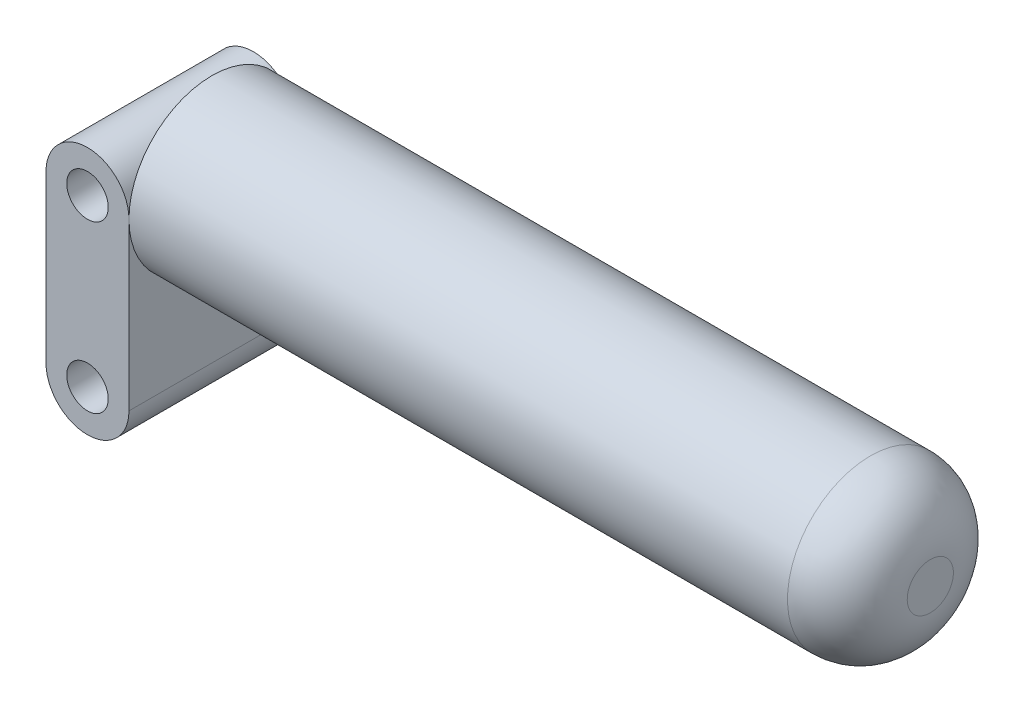
ISO-10303-21;
HEADER;
FILE_DESCRIPTION(('STEP AP214'),'2;1');
FILE_NAME('part.step','',(''),(''),'','','');
FILE_SCHEMA(('AUTOMOTIVE_DESIGN { 1 0 10303 214 1 1 1 1 }'));
ENDSEC;
DATA;
#1=APPLICATION_CONTEXT('core data for automotive mechanical design processes');
#2=APPLICATION_PROTOCOL_DEFINITION('international standard','automotive_design',2000,#1);
#3=PRODUCT_CONTEXT('',#1,'mechanical');
#4=PRODUCT('Part','Part','',(#3));
#5=PRODUCT_RELATED_PRODUCT_CATEGORY('part','',(#4));
#6=PRODUCT_DEFINITION_FORMATION('','',#4);
#7=PRODUCT_DEFINITION_CONTEXT('part definition',#1,'design');
#8=PRODUCT_DEFINITION('design','',#6,#7);
#9=PRODUCT_DEFINITION_SHAPE('','',#8);
#10=(LENGTH_UNIT() NAMED_UNIT(*) SI_UNIT(.MILLI.,.METRE.));
#11=(NAMED_UNIT(*) PLANE_ANGLE_UNIT() SI_UNIT($,.RADIAN.));
#12=(NAMED_UNIT(*) SI_UNIT($,.STERADIAN.) SOLID_ANGLE_UNIT());
#13=UNCERTAINTY_MEASURE_WITH_UNIT(LENGTH_MEASURE(1.E-05),#10,'distance_accuracy_value','');
#14=(GEOMETRIC_REPRESENTATION_CONTEXT(3) GLOBAL_UNCERTAINTY_ASSIGNED_CONTEXT((#13)) GLOBAL_UNIT_ASSIGNED_CONTEXT((#10,
#11,#12)) REPRESENTATION_CONTEXT('',''));
#15=CARTESIAN_POINT('',(0.,0.,0.));
#16=DIRECTION('',(0.,0.,1.));
#17=DIRECTION('',(1.,0.,0.));
#18=AXIS2_PLACEMENT_3D('',#15,#16,#17);
#19=CARTESIAN_POINT('',(0.,10.,10.));
#20=DIRECTION('',(0.,0.,1.));
#21=DIRECTION('',(1.,0.,0.));
#22=AXIS2_PLACEMENT_3D('',#19,#20,#21);
#23=PLANE('',#22);
#24=CARTESIAN_POINT('',(0.,10.,10.));
#25=DIRECTION('',(0.,0.,1.));
#26=DIRECTION('',(1.,0.,0.));
#27=AXIS2_PLACEMENT_3D('',#24,#25,#26);
#28=CIRCLE('',#27,2.5);
#29=CARTESIAN_POINT('',(2.5,10.,10.));
#30=VERTEX_POINT('',#29);
#31=EDGE_CURVE('E94',#30,#30,#28,.T.);
#32=ORIENTED_EDGE('',*,*,#31,.F.);
#33=EDGE_LOOP('',(#32));
#34=FACE_BOUND('',#33,.T.);
#35=CARTESIAN_POINT('',(0.,10.,10.));
#36=DIRECTION('',(0.,0.,1.));
#37=DIRECTION('',(1.,0.,0.));
#38=AXIS2_PLACEMENT_3D('',#35,#36,#37);
#39=CIRCLE('',#38,5.);
#40=CARTESIAN_POINT('',(5.,10.,10.));
#41=VERTEX_POINT('',#40);
#42=CARTESIAN_POINT('',(-5.,10.,10.));
#43=VERTEX_POINT('',#42);
#44=EDGE_CURVE('E100',#41,#43,#39,.T.);
#45=ORIENTED_EDGE('',*,*,#44,.T.);
#46=DIRECTION('',(0.,-1.,0.));
#47=VECTOR('',#46,1.);
#48=CARTESIAN_POINT('',(-5.,10.,10.));
#49=LINE('',#48,#47);
#50=CARTESIAN_POINT('',(-4.99999999999999,-10.,10.));
#51=VERTEX_POINT('',#50);
#52=EDGE_CURVE('E80',#43,#51,#49,.T.);
#53=ORIENTED_EDGE('',*,*,#52,.T.);
#54=CARTESIAN_POINT('',(0.,-10.,10.));
#55=DIRECTION('',(0.,0.,1.));
#56=DIRECTION('',(1.,0.,0.));
#57=AXIS2_PLACEMENT_3D('',#54,#55,#56);
#58=CIRCLE('',#57,5.);
#59=CARTESIAN_POINT('',(5.,-10.,10.));
#60=VERTEX_POINT('',#59);
#61=EDGE_CURVE('E128',#51,#60,#58,.T.);
#62=ORIENTED_EDGE('',*,*,#61,.T.);
#63=DIRECTION('',(0.,1.,0.));
#64=VECTOR('',#63,1.);
#65=CARTESIAN_POINT('',(5.,10.,10.));
#66=LINE('',#65,#64);
#67=EDGE_CURVE('E105',#60,#41,#66,.T.);
#68=ORIENTED_EDGE('',*,*,#67,.T.);
#69=EDGE_LOOP('',(#45,#53,#62,#68));
#70=FACE_BOUND('',#69,.T.);
#71=CARTESIAN_POINT('',(0.,-10.,10.));
#72=DIRECTION('',(0.,0.,1.));
#73=DIRECTION('',(-1.,0.,0.));
#74=AXIS2_PLACEMENT_3D('',#71,#72,#73);
#75=CIRCLE('',#74,2.5);
#76=CARTESIAN_POINT('',(-2.5,-10.,10.));
#77=VERTEX_POINT('',#76);
#78=EDGE_CURVE('E116',#77,#77,#75,.T.);
#79=ORIENTED_EDGE('',*,*,#78,.F.);
#80=EDGE_LOOP('',(#79));
#81=FACE_BOUND('',#80,.T.);
#82=ADVANCED_FACE('F36',(#34,#70,#81),#23,.T.);
#83=CARTESIAN_POINT('',(0.,10.,-10.));
#84=DIRECTION('',(0.,0.,1.));
#85=DIRECTION('',(1.,0.,0.));
#86=AXIS2_PLACEMENT_3D('',#83,#84,#85);
#87=PLANE('',#86);
#88=CARTESIAN_POINT('',(0.,10.,-10.));
#89=DIRECTION('',(0.,0.,1.));
#90=DIRECTION('',(1.,0.,0.));
#91=AXIS2_PLACEMENT_3D('',#88,#89,#90);
#92=CIRCLE('',#91,5.);
#93=CARTESIAN_POINT('',(5.,10.,-10.));
#94=VERTEX_POINT('',#93);
#95=CARTESIAN_POINT('',(-5.,10.,-10.));
#96=VERTEX_POINT('',#95);
#97=EDGE_CURVE('E87',#94,#96,#92,.T.);
#98=ORIENTED_EDGE('',*,*,#97,.F.);
#99=DIRECTION('',(0.,1.,0.));
#100=VECTOR('',#99,1.);
#101=CARTESIAN_POINT('',(5.,10.,-10.));
#102=LINE('',#101,#100);
#103=CARTESIAN_POINT('',(5.,-10.,-10.));
#104=VERTEX_POINT('',#103);
#105=EDGE_CURVE('E91',#104,#94,#102,.T.);
#106=ORIENTED_EDGE('',*,*,#105,.F.);
#107=CARTESIAN_POINT('',(0.,-10.,-10.));
#108=DIRECTION('',(0.,0.,1.));
#109=DIRECTION('',(1.,0.,0.));
#110=AXIS2_PLACEMENT_3D('',#107,#108,#109);
#111=CIRCLE('',#110,5.);
#112=CARTESIAN_POINT('',(-4.99999999999999,-10.,-10.));
#113=VERTEX_POINT('',#112);
#114=EDGE_CURVE('E75',#113,#104,#111,.T.);
#115=ORIENTED_EDGE('',*,*,#114,.F.);
#116=DIRECTION('',(0.,-1.,0.));
#117=VECTOR('',#116,1.);
#118=CARTESIAN_POINT('',(-5.,10.,-10.));
#119=LINE('',#118,#117);
#120=EDGE_CURVE('E68',#96,#113,#119,.T.);
#121=ORIENTED_EDGE('',*,*,#120,.F.);
#122=EDGE_LOOP('',(#98,#106,#115,#121));
#123=FACE_BOUND('',#122,.T.);
#124=CARTESIAN_POINT('',(0.,10.,-10.));
#125=DIRECTION('',(0.,0.,1.));
#126=DIRECTION('',(1.,0.,0.));
#127=AXIS2_PLACEMENT_3D('',#124,#125,#126);
#128=CIRCLE('',#127,2.5);
#129=CARTESIAN_POINT('',(2.5,10.,-10.));
#130=VERTEX_POINT('',#129);
#131=EDGE_CURVE('E120',#130,#130,#128,.T.);
#132=ORIENTED_EDGE('',*,*,#131,.T.);
#133=EDGE_LOOP('',(#132));
#134=FACE_BOUND('',#133,.T.);
#135=CARTESIAN_POINT('',(0.,-10.,-10.));
#136=DIRECTION('',(0.,0.,1.));
#137=DIRECTION('',(-1.,0.,0.));
#138=AXIS2_PLACEMENT_3D('',#135,#136,#137);
#139=CIRCLE('',#138,2.5);
#140=CARTESIAN_POINT('',(-2.5,-10.,-10.));
#141=VERTEX_POINT('',#140);
#142=EDGE_CURVE('E114',#141,#141,#139,.T.);
#143=ORIENTED_EDGE('',*,*,#142,.T.);
#144=EDGE_LOOP('',(#143));
#145=FACE_BOUND('',#144,.T.);
#146=ADVANCED_FACE('F89',(#123,#134,#145),#87,.F.);
#147=CARTESIAN_POINT('',(0.,10.,10.));
#148=DIRECTION('',(0.,0.,-1.));
#149=DIRECTION('',(-1.,0.,0.));
#150=AXIS2_PLACEMENT_3D('',#147,#148,#149);
#151=CYLINDRICAL_SURFACE('',#150,5.);
#152=ORIENTED_EDGE('',*,*,#97,.T.);
#153=DIRECTION('',(0.,0.,-1.));
#154=VECTOR('',#153,1.);
#155=CARTESIAN_POINT('',(-5.,10.,10.));
#156=LINE('',#155,#154);
#157=EDGE_CURVE('E136',#43,#96,#156,.T.);
#158=ORIENTED_EDGE('',*,*,#157,.F.);
#159=ORIENTED_EDGE('',*,*,#44,.F.);
#160=DIRECTION('',(0.,0.,-1.));
#161=VECTOR('',#160,1.);
#162=CARTESIAN_POINT('',(5.,10.,10.));
#163=LINE('',#162,#161);
#164=EDGE_CURVE('E98',#41,#94,#163,.T.);
#165=ORIENTED_EDGE('',*,*,#164,.T.);
#166=EDGE_LOOP('',(#152,#158,#159,#165));
#167=FACE_BOUND('',#166,.T.);
#168=ADVANCED_FACE('F99',(#167),#151,.T.);
#169=CARTESIAN_POINT('',(-5.,10.,10.));
#170=DIRECTION('',(1.,0.,0.));
#171=DIRECTION('',(0.,1.,0.));
#172=AXIS2_PLACEMENT_3D('',#169,#170,#171);
#173=PLANE('',#172);
#174=ORIENTED_EDGE('',*,*,#120,.T.);
#175=DIRECTION('',(0.,0.,-1.));
#176=VECTOR('',#175,1.);
#177=CARTESIAN_POINT('',(-4.99999999999999,-10.,10.));
#178=LINE('',#177,#176);
#179=EDGE_CURVE('E134',#51,#113,#178,.T.);
#180=ORIENTED_EDGE('',*,*,#179,.F.);
#181=ORIENTED_EDGE('',*,*,#52,.F.);
#182=ORIENTED_EDGE('',*,*,#157,.T.);
#183=EDGE_LOOP('',(#174,#180,#181,#182));
#184=FACE_BOUND('',#183,.T.);
#185=ADVANCED_FACE('F167',(#184),#173,.F.);
#186=CARTESIAN_POINT('',(0.,-10.,10.));
#187=DIRECTION('',(0.,0.,-1.));
#188=DIRECTION('',(-1.,0.,0.));
#189=AXIS2_PLACEMENT_3D('',#186,#187,#188);
#190=CYLINDRICAL_SURFACE('',#189,5.);
#191=ORIENTED_EDGE('',*,*,#114,.T.);
#192=DIRECTION('',(0.,0.,-1.));
#193=VECTOR('',#192,1.);
#194=CARTESIAN_POINT('',(5.,-10.,10.));
#195=LINE('',#194,#193);
#196=EDGE_CURVE('E104',#60,#104,#195,.T.);
#197=ORIENTED_EDGE('',*,*,#196,.F.);
#198=ORIENTED_EDGE('',*,*,#61,.F.);
#199=ORIENTED_EDGE('',*,*,#179,.T.);
#200=EDGE_LOOP('',(#191,#197,#198,#199));
#201=FACE_BOUND('',#200,.T.);
#202=ADVANCED_FACE('F164',(#201),#190,.T.);
#203=CARTESIAN_POINT('',(5.,10.,10.));
#204=DIRECTION('',(-1.,0.,0.));
#205=DIRECTION('',(0.,-1.,0.));
#206=AXIS2_PLACEMENT_3D('',#203,#204,#205);
#207=PLANE('',#206);
#208=CARTESIAN_POINT('',(5.,10.,0.));
#209=DIRECTION('',(1.,0.,0.));
#210=DIRECTION('',(0.,1.,0.));
#211=AXIS2_PLACEMENT_3D('',#208,#209,#210);
#212=CIRCLE('',#211,10.);
#213=EDGE_CURVE('E53',#41,#94,#212,.T.);
#214=ORIENTED_EDGE('',*,*,#213,.F.);
#215=ORIENTED_EDGE('',*,*,#67,.F.);
#216=ORIENTED_EDGE('',*,*,#196,.T.);
#217=ORIENTED_EDGE('',*,*,#105,.T.);
#218=EDGE_LOOP('',(#214,#215,#216,#217));
#219=FACE_BOUND('',#218,.T.);
#220=ADVANCED_FACE('F107',(#219),#207,.F.);
#221=CARTESIAN_POINT('',(0.,10.,10.));
#222=DIRECTION('',(0.,0.,-1.));
#223=DIRECTION('',(-1.,0.,0.));
#224=AXIS2_PLACEMENT_3D('',#221,#222,#223);
#225=CYLINDRICAL_SURFACE('',#224,2.5);
#226=ORIENTED_EDGE('',*,*,#31,.T.);
#227=EDGE_LOOP('',(#226));
#228=FACE_BOUND('',#227,.T.);
#229=ORIENTED_EDGE('',*,*,#131,.F.);
#230=EDGE_LOOP('',(#229));
#231=FACE_BOUND('',#230,.T.);
#232=ADVANCED_FACE('F159',(#228,#231),#225,.F.);
#233=CARTESIAN_POINT('',(0.,-10.,10.));
#234=DIRECTION('',(0.,0.,-1.));
#235=DIRECTION('',(-1.,0.,0.));
#236=AXIS2_PLACEMENT_3D('',#233,#234,#235);
#237=CYLINDRICAL_SURFACE('',#236,2.5);
#238=ORIENTED_EDGE('',*,*,#78,.T.);
#239=EDGE_LOOP('',(#238));
#240=FACE_BOUND('',#239,.T.);
#241=ORIENTED_EDGE('',*,*,#142,.F.);
#242=EDGE_LOOP('',(#241));
#243=FACE_BOUND('',#242,.T.);
#244=ADVANCED_FACE('F193',(#240,#243),#237,.F.);
#245=CARTESIAN_POINT('',(91.6,10.,0.));
#246=DIRECTION('',(-1.,0.,0.));
#247=DIRECTION('',(0.,-1.,0.));
#248=AXIS2_PLACEMENT_3D('',#245,#246,#247);
#249=CYLINDRICAL_SURFACE('',#248,10.);
#250=CARTESIAN_POINT('',(84.3833333333333,10.,0.));
#251=DIRECTION('',(1.,0.,0.));
#252=DIRECTION('',(0.,1.,0.));
#253=AXIS2_PLACEMENT_3D('',#250,#251,#252);
#254=CIRCLE('',#253,10.);
#255=CARTESIAN_POINT('',(84.3833333333333,20.,0.));
#256=VERTEX_POINT('',#255);
#257=EDGE_CURVE('E11',#256,#256,#254,.F.);
#258=ORIENTED_EDGE('',*,*,#257,.T.);
#259=EDGE_LOOP('',(#258));
#260=FACE_BOUND('',#259,.T.);
#261=ORIENTED_EDGE('',*,*,#213,.T.);
#262=EDGE_CURVE('E109',#94,#41,#212,.T.);
#263=ORIENTED_EDGE('',*,*,#262,.T.);
#264=EDGE_LOOP('',(#261,#263));
#265=FACE_BOUND('',#264,.T.);
#266=ADVANCED_FACE('F113',(#260,#265),#249,.T.);
#267=CARTESIAN_POINT('',(91.6,10.,0.));
#268=DIRECTION('',(1.,0.,0.));
#269=DIRECTION('',(0.,1.,0.));
#270=AXIS2_PLACEMENT_3D('',#267,#268,#269);
#271=PLANE('',#270);
#272=CARTESIAN_POINT('',(91.6,10.,0.));
#273=DIRECTION('',(1.,0.,0.));
#274=DIRECTION('',(0.,1.,0.));
#275=AXIS2_PLACEMENT_3D('',#272,#273,#274);
#276=CIRCLE('',#275,2.78333333333333);
#277=CARTESIAN_POINT('',(91.6,12.7833333333334,0.));
#278=VERTEX_POINT('',#277);
#279=EDGE_CURVE('E45',#278,#278,#276,.T.);
#280=ORIENTED_EDGE('',*,*,#279,.T.);
#281=EDGE_LOOP('',(#280));
#282=FACE_BOUND('',#281,.T.);
#283=ADVANCED_FACE('F140',(#282),#271,.T.);
#284=CARTESIAN_POINT('',(5.,10.,0.));
#285=DIRECTION('',(1.,0.,0.));
#286=DIRECTION('',(0.,1.,0.));
#287=AXIS2_PLACEMENT_3D('',#284,#285,#286);
#288=PLANE('',#287);
#289=ORIENTED_EDGE('',*,*,#164,.F.);
#290=ORIENTED_EDGE('',*,*,#262,.F.);
#291=EDGE_LOOP('',(#289,#290));
#292=FACE_BOUND('',#291,.T.);
#293=ADVANCED_FACE('F110',(#292),#288,.F.);
#294=CARTESIAN_POINT('',(84.3833333333333,10.,0.));
#295=DIRECTION('',(1.,0.,0.));
#296=DIRECTION('',(0.,1.,0.));
#297=AXIS2_PLACEMENT_3D('',#294,#295,#296);
#298=DEGENERATE_TOROIDAL_SURFACE('',#297,2.78333333333333,7.21666666666667,.T.);
#299=ORIENTED_EDGE('',*,*,#257,.F.);
#300=EDGE_LOOP('',(#299));
#301=FACE_BOUND('',#300,.T.);
#302=ORIENTED_EDGE('',*,*,#279,.F.);
#303=EDGE_LOOP('',(#302));
#304=FACE_BOUND('',#303,.T.);
#305=ADVANCED_FACE('F38',(#301,#304),#298,.T.);
#306=CLOSED_SHELL('',(#82,#146,#168,#185,#202,#220,#232,#244,#266,#283,#293,#305));
#307=MANIFOLD_SOLID_BREP('B2',#306);
#308=ADVANCED_BREP_SHAPE_REPRESENTATION('',(#18,#307),#14);
#309=SHAPE_DEFINITION_REPRESENTATION(#9,#308);
ENDSEC;
END-ISO-10303-21;
